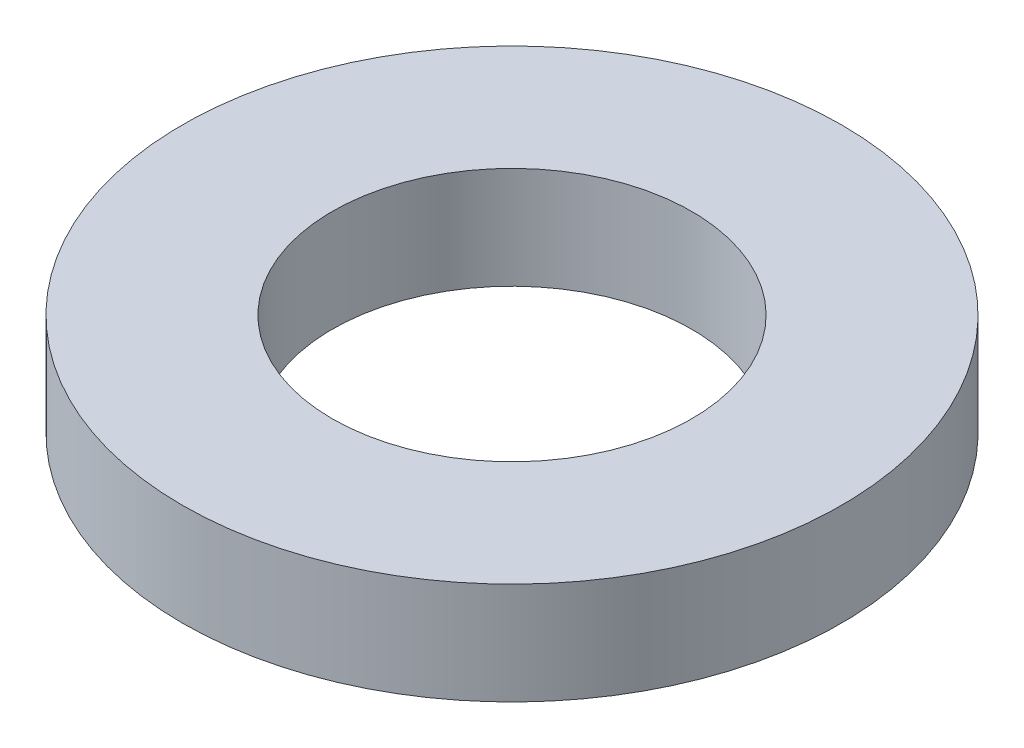
ISO-10303-21;
HEADER;
FILE_DESCRIPTION(('STEP AP214'),'2;1');
FILE_NAME('part.step','',(''),(''),'','','');
FILE_SCHEMA(('AUTOMOTIVE_DESIGN { 1 0 10303 214 1 1 1 1 }'));
ENDSEC;
DATA;
#1=APPLICATION_CONTEXT('core data for automotive mechanical design processes');
#2=APPLICATION_PROTOCOL_DEFINITION('international standard','automotive_design',2000,#1);
#3=PRODUCT_CONTEXT('',#1,'mechanical');
#4=PRODUCT('Part','Part','',(#3));
#5=PRODUCT_RELATED_PRODUCT_CATEGORY('part','',(#4));
#6=PRODUCT_DEFINITION_FORMATION('','',#4);
#7=PRODUCT_DEFINITION_CONTEXT('part definition',#1,'design');
#8=PRODUCT_DEFINITION('design','',#6,#7);
#9=PRODUCT_DEFINITION_SHAPE('','',#8);
#10=(LENGTH_UNIT() NAMED_UNIT(*) SI_UNIT(.MILLI.,.METRE.));
#11=(NAMED_UNIT(*) PLANE_ANGLE_UNIT() SI_UNIT($,.RADIAN.));
#12=(NAMED_UNIT(*) SI_UNIT($,.STERADIAN.) SOLID_ANGLE_UNIT());
#13=UNCERTAINTY_MEASURE_WITH_UNIT(LENGTH_MEASURE(1.E-05),#10,'distance_accuracy_value','');
#14=(GEOMETRIC_REPRESENTATION_CONTEXT(3) GLOBAL_UNCERTAINTY_ASSIGNED_CONTEXT((#13)) GLOBAL_UNIT_ASSIGNED_CONTEXT((#10,
#11,#12)) REPRESENTATION_CONTEXT('',''));
#15=CARTESIAN_POINT('',(0.,0.,0.));
#16=DIRECTION('',(0.,0.,1.));
#17=DIRECTION('',(1.,0.,0.));
#18=AXIS2_PLACEMENT_3D('',#15,#16,#17);
#19=CARTESIAN_POINT('',(0.,1.8034,0.));
#20=DIRECTION('',(0.,1.,0.));
#21=DIRECTION('',(0.,0.,1.));
#22=AXIS2_PLACEMENT_3D('',#19,#20,#21);
#23=PLANE('',#22);
#24=CARTESIAN_POINT('',(0.,1.8034,0.));
#25=DIRECTION('',(0.,1.,0.));
#26=DIRECTION('',(0.,0.,1.));
#27=AXIS2_PLACEMENT_3D('',#24,#25,#26);
#28=CIRCLE('',#27,11.6459);
#29=CARTESIAN_POINT('',(0.,1.8034,11.6459));
#30=VERTEX_POINT('',#29);
#31=EDGE_CURVE('E10',#30,#30,#28,.T.);
#32=ORIENTED_EDGE('',*,*,#31,.T.);
#33=EDGE_LOOP('',(#32));
#34=FACE_BOUND('',#33,.T.);
#35=CARTESIAN_POINT('',(0.,1.8034,0.));
#36=DIRECTION('',(0.,1.,0.));
#37=DIRECTION('',(0.,0.,1.));
#38=AXIS2_PLACEMENT_3D('',#35,#36,#37);
#39=CIRCLE('',#38,6.35);
#40=CARTESIAN_POINT('',(0.,1.8034,6.35));
#41=VERTEX_POINT('',#40);
#42=EDGE_CURVE('E51',#41,#41,#39,.T.);
#43=ORIENTED_EDGE('',*,*,#42,.F.);
#44=EDGE_LOOP('',(#43));
#45=FACE_BOUND('',#44,.T.);
#46=ADVANCED_FACE('F38',(#34,#45),#23,.T.);
#47=CARTESIAN_POINT('',(0.,-1.8034,0.));
#48=DIRECTION('',(0.,1.,0.));
#49=DIRECTION('',(0.,0.,1.));
#50=AXIS2_PLACEMENT_3D('',#47,#48,#49);
#51=PLANE('',#50);
#52=CARTESIAN_POINT('',(0.,-1.8034,0.));
#53=DIRECTION('',(0.,1.,0.));
#54=DIRECTION('',(0.,0.,1.));
#55=AXIS2_PLACEMENT_3D('',#52,#53,#54);
#56=CIRCLE('',#55,11.6459);
#57=CARTESIAN_POINT('',(0.,-1.8034,11.6459));
#58=VERTEX_POINT('',#57);
#59=EDGE_CURVE('E42',#58,#58,#56,.T.);
#60=ORIENTED_EDGE('',*,*,#59,.F.);
#61=EDGE_LOOP('',(#60));
#62=FACE_BOUND('',#61,.T.);
#63=CARTESIAN_POINT('',(0.,-1.8034,0.));
#64=DIRECTION('',(0.,1.,0.));
#65=DIRECTION('',(0.,0.,1.));
#66=AXIS2_PLACEMENT_3D('',#63,#64,#65);
#67=CIRCLE('',#66,6.35);
#68=CARTESIAN_POINT('',(0.,-1.8034,6.35));
#69=VERTEX_POINT('',#68);
#70=EDGE_CURVE('E53',#69,#69,#67,.T.);
#71=ORIENTED_EDGE('',*,*,#70,.T.);
#72=EDGE_LOOP('',(#71));
#73=FACE_BOUND('',#72,.T.);
#74=ADVANCED_FACE('F65',(#62,#73),#51,.F.);
#75=CARTESIAN_POINT('',(0.,1.8034,0.));
#76=DIRECTION('',(0.,-1.,0.));
#77=DIRECTION('',(0.,0.,-1.));
#78=AXIS2_PLACEMENT_3D('',#75,#76,#77);
#79=CYLINDRICAL_SURFACE('',#78,11.6459);
#80=ORIENTED_EDGE('',*,*,#31,.F.);
#81=EDGE_LOOP('',(#80));
#82=FACE_BOUND('',#81,.T.);
#83=ORIENTED_EDGE('',*,*,#59,.T.);
#84=EDGE_LOOP('',(#83));
#85=FACE_BOUND('',#84,.T.);
#86=ADVANCED_FACE('F40',(#82,#85),#79,.T.);
#87=CARTESIAN_POINT('',(0.,1.8034,0.));
#88=DIRECTION('',(0.,-1.,0.));
#89=DIRECTION('',(0.,0.,-1.));
#90=AXIS2_PLACEMENT_3D('',#87,#88,#89);
#91=CYLINDRICAL_SURFACE('',#90,6.35);
#92=ORIENTED_EDGE('',*,*,#42,.T.);
#93=EDGE_LOOP('',(#92));
#94=FACE_BOUND('',#93,.T.);
#95=ORIENTED_EDGE('',*,*,#70,.F.);
#96=EDGE_LOOP('',(#95));
#97=FACE_BOUND('',#96,.T.);
#98=ADVANCED_FACE('F61',(#94,#97),#91,.F.);
#99=CLOSED_SHELL('',(#46,#74,#86,#98));
#100=MANIFOLD_SOLID_BREP('B2',#99);
#101=ADVANCED_BREP_SHAPE_REPRESENTATION('',(#18,#100),#14);
#102=SHAPE_DEFINITION_REPRESENTATION(#9,#101);
ENDSEC;
END-ISO-10303-21;
